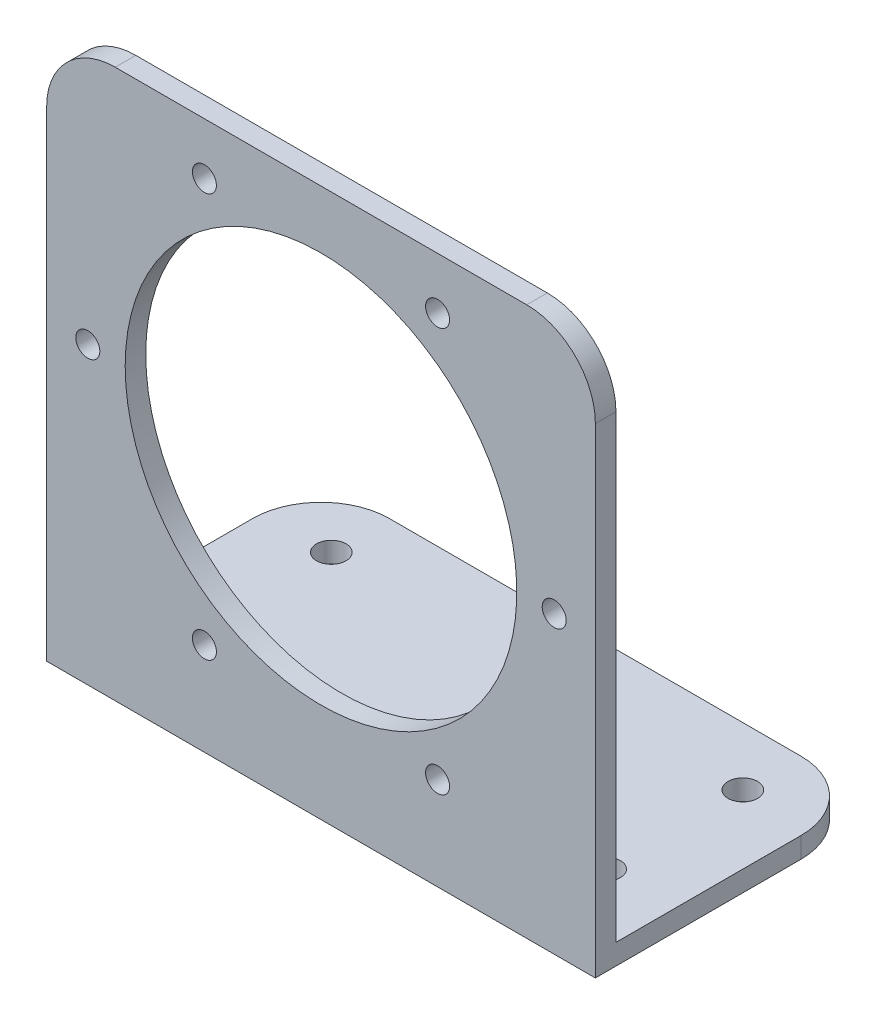
ISO-10303-21;
HEADER;
FILE_DESCRIPTION(('STEP AP214'),'2;1');
FILE_NAME('part.step','',(''),(''),'','','');
FILE_SCHEMA(('AUTOMOTIVE_DESIGN { 1 0 10303 214 1 1 1 1 }'));
ENDSEC;
DATA;
#1=APPLICATION_CONTEXT('core data for automotive mechanical design processes');
#2=APPLICATION_PROTOCOL_DEFINITION('international standard','automotive_design',2000,#1);
#3=PRODUCT_CONTEXT('',#1,'mechanical');
#4=PRODUCT('Part','Part','',(#3));
#5=PRODUCT_RELATED_PRODUCT_CATEGORY('part','',(#4));
#6=PRODUCT_DEFINITION_FORMATION('','',#4);
#7=PRODUCT_DEFINITION_CONTEXT('part definition',#1,'design');
#8=PRODUCT_DEFINITION('design','',#6,#7);
#9=PRODUCT_DEFINITION_SHAPE('','',#8);
#10=(LENGTH_UNIT() NAMED_UNIT(*) SI_UNIT(.MILLI.,.METRE.));
#11=(NAMED_UNIT(*) PLANE_ANGLE_UNIT() SI_UNIT($,.RADIAN.));
#12=(NAMED_UNIT(*) SI_UNIT($,.STERADIAN.) SOLID_ANGLE_UNIT());
#13=UNCERTAINTY_MEASURE_WITH_UNIT(LENGTH_MEASURE(1.E-05),#10,'distance_accuracy_value','');
#14=(GEOMETRIC_REPRESENTATION_CONTEXT(3) GLOBAL_UNCERTAINTY_ASSIGNED_CONTEXT((#13)) GLOBAL_UNIT_ASSIGNED_CONTEXT((#10,
#11,#12)) REPRESENTATION_CONTEXT('',''));
#15=CARTESIAN_POINT('',(0.,0.,0.));
#16=DIRECTION('',(0.,0.,1.));
#17=DIRECTION('',(1.,0.,0.));
#18=AXIS2_PLACEMENT_3D('',#15,#16,#17);
#19=CARTESIAN_POINT('',(40.,0.,0.));
#20=DIRECTION('',(0.,1.,0.));
#21=DIRECTION('',(0.,0.,1.));
#22=AXIS2_PLACEMENT_3D('',#19,#20,#21);
#23=PLANE('',#22);
#24=CARTESIAN_POINT('',(30.,0.,-31.5));
#25=DIRECTION('',(0.,1.,0.));
#26=DIRECTION('',(0.,0.,-1.));
#27=AXIS2_PLACEMENT_3D('',#24,#25,#26);
#28=CIRCLE('',#27,2.15);
#29=CARTESIAN_POINT('',(30.,0.,-33.65));
#30=VERTEX_POINT('',#29);
#31=EDGE_CURVE('E339',#30,#30,#28,.T.);
#32=ORIENTED_EDGE('',*,*,#31,.T.);
#33=EDGE_LOOP('',(#32));
#34=FACE_BOUND('',#33,.T.);
#35=CARTESIAN_POINT('',(30.,0.,-11.5));
#36=DIRECTION('',(0.,1.,0.));
#37=DIRECTION('',(0.,0.,1.));
#38=AXIS2_PLACEMENT_3D('',#35,#36,#37);
#39=CIRCLE('',#38,2.15);
#40=CARTESIAN_POINT('',(30.,0.,-9.35));
#41=VERTEX_POINT('',#40);
#42=EDGE_CURVE('E329',#41,#41,#39,.T.);
#43=ORIENTED_EDGE('',*,*,#42,.T.);
#44=EDGE_LOOP('',(#43));
#45=FACE_BOUND('',#44,.T.);
#46=CARTESIAN_POINT('',(-30.,0.,-11.5));
#47=DIRECTION('',(0.,1.,0.));
#48=DIRECTION('',(0.,0.,-1.));
#49=AXIS2_PLACEMENT_3D('',#46,#47,#48);
#50=CIRCLE('',#49,2.15);
#51=CARTESIAN_POINT('',(-30.,0.,-13.65));
#52=VERTEX_POINT('',#51);
#53=EDGE_CURVE('E324',#52,#52,#50,.T.);
#54=ORIENTED_EDGE('',*,*,#53,.T.);
#55=EDGE_LOOP('',(#54));
#56=FACE_BOUND('',#55,.T.);
#57=CARTESIAN_POINT('',(-30.,0.,-31.5));
#58=DIRECTION('',(0.,1.,0.));
#59=DIRECTION('',(0.,0.,1.));
#60=AXIS2_PLACEMENT_3D('',#57,#58,#59);
#61=CIRCLE('',#60,2.15);
#62=CARTESIAN_POINT('',(-30.,0.,-29.35));
#63=VERTEX_POINT('',#62);
#64=EDGE_CURVE('E345',#63,#63,#61,.T.);
#65=ORIENTED_EDGE('',*,*,#64,.T.);
#66=EDGE_LOOP('',(#65));
#67=FACE_BOUND('',#66,.T.);
#68=DIRECTION('',(0.,0.,-1.));
#69=VECTOR('',#68,1.);
#70=CARTESIAN_POINT('',(-40.,0.,0.));
#71=LINE('',#70,#69);
#72=CARTESIAN_POINT('',(-40.,0.,0.));
#73=VERTEX_POINT('',#72);
#74=CARTESIAN_POINT('',(-40.,0.,-30.));
#75=VERTEX_POINT('',#74);
#76=EDGE_CURVE('E169',#73,#75,#71,.T.);
#77=ORIENTED_EDGE('',*,*,#76,.T.);
#78=CARTESIAN_POINT('',(-30.,0.,-30.));
#79=DIRECTION('',(0.,1.,0.));
#80=DIRECTION('',(0.,0.,1.));
#81=AXIS2_PLACEMENT_3D('',#78,#79,#80);
#82=CIRCLE('',#81,10.);
#83=CARTESIAN_POINT('',(-30.,0.,-40.));
#84=VERTEX_POINT('',#83);
#85=EDGE_CURVE('E12',#75,#84,#82,.F.);
#86=ORIENTED_EDGE('',*,*,#85,.T.);
#87=DIRECTION('',(-1.,0.,0.));
#88=VECTOR('',#87,1.);
#89=CARTESIAN_POINT('',(40.,0.,-40.));
#90=LINE('',#89,#88);
#91=CARTESIAN_POINT('',(30.,0.,-40.));
#92=VERTEX_POINT('',#91);
#93=EDGE_CURVE('E174',#92,#84,#90,.T.);
#94=ORIENTED_EDGE('',*,*,#93,.F.);
#95=CARTESIAN_POINT('',(30.,0.,-30.));
#96=DIRECTION('',(0.,1.,0.));
#97=DIRECTION('',(0.,0.,1.));
#98=AXIS2_PLACEMENT_3D('',#95,#96,#97);
#99=CIRCLE('',#98,10.);
#100=CARTESIAN_POINT('',(40.,0.,-30.));
#101=VERTEX_POINT('',#100);
#102=EDGE_CURVE('E67',#92,#101,#99,.F.);
#103=ORIENTED_EDGE('',*,*,#102,.T.);
#104=DIRECTION('',(0.,0.,-1.));
#105=VECTOR('',#104,1.);
#106=CARTESIAN_POINT('',(40.,0.,0.));
#107=LINE('',#106,#105);
#108=CARTESIAN_POINT('',(40.,0.,0.));
#109=VERTEX_POINT('',#108);
#110=EDGE_CURVE('E164',#109,#101,#107,.T.);
#111=ORIENTED_EDGE('',*,*,#110,.F.);
#112=DIRECTION('',(-1.,0.,0.));
#113=VECTOR('',#112,1.);
#114=CARTESIAN_POINT('',(40.,0.,0.));
#115=LINE('',#114,#113);
#116=EDGE_CURVE('E179',#109,#73,#115,.T.);
#117=ORIENTED_EDGE('',*,*,#116,.T.);
#118=EDGE_LOOP('',(#77,#86,#94,#103,#111,#117));
#119=FACE_BOUND('',#118,.T.);
#120=ADVANCED_FACE('F59',(#34,#45,#56,#67,#119),#23,.F.);
#121=CARTESIAN_POINT('',(40.,0.,-40.));
#122=DIRECTION('',(0.,0.,1.));
#123=DIRECTION('',(1.,0.,0.));
#124=AXIS2_PLACEMENT_3D('',#121,#122,#123);
#125=PLANE('',#124);
#126=ORIENTED_EDGE('',*,*,#93,.T.);
#127=DIRECTION('',(0.,1.,0.));
#128=VECTOR('',#127,1.);
#129=CARTESIAN_POINT('',(-30.,0.,-40.));
#130=LINE('',#129,#128);
#131=CARTESIAN_POINT('',(-30.,3.,-40.));
#132=VERTEX_POINT('',#131);
#133=EDGE_CURVE('E212',#84,#132,#130,.T.);
#134=ORIENTED_EDGE('',*,*,#133,.T.);
#135=DIRECTION('',(-1.,0.,0.));
#136=VECTOR('',#135,1.);
#137=CARTESIAN_POINT('',(40.,3.,-40.));
#138=LINE('',#137,#136);
#139=CARTESIAN_POINT('',(30.,3.,-40.));
#140=VERTEX_POINT('',#139);
#141=EDGE_CURVE('E147',#140,#132,#138,.T.);
#142=ORIENTED_EDGE('',*,*,#141,.F.);
#143=DIRECTION('',(0.,1.,0.));
#144=VECTOR('',#143,1.);
#145=CARTESIAN_POINT('',(30.,0.,-40.));
#146=LINE('',#145,#144);
#147=EDGE_CURVE('E79',#140,#92,#146,.F.);
#148=ORIENTED_EDGE('',*,*,#147,.T.);
#149=EDGE_LOOP('',(#126,#134,#142,#148));
#150=FACE_BOUND('',#149,.T.);
#151=ADVANCED_FACE('F222',(#150),#125,.F.);
#152=CARTESIAN_POINT('',(40.,3.,0.));
#153=DIRECTION('',(0.,1.,0.));
#154=DIRECTION('',(0.,0.,1.));
#155=AXIS2_PLACEMENT_3D('',#152,#153,#154);
#156=PLANE('',#155);
#157=CARTESIAN_POINT('',(30.,3.,-31.5));
#158=DIRECTION('',(0.,1.,0.));
#159=DIRECTION('',(0.,0.,-1.));
#160=AXIS2_PLACEMENT_3D('',#157,#158,#159);
#161=CIRCLE('',#160,2.15);
#162=CARTESIAN_POINT('',(30.,3.,-33.65));
#163=VERTEX_POINT('',#162);
#164=EDGE_CURVE('E342',#163,#163,#161,.T.);
#165=ORIENTED_EDGE('',*,*,#164,.F.);
#166=EDGE_LOOP('',(#165));
#167=FACE_BOUND('',#166,.T.);
#168=CARTESIAN_POINT('',(30.,3.,-11.5));
#169=DIRECTION('',(0.,1.,0.));
#170=DIRECTION('',(0.,0.,1.));
#171=AXIS2_PLACEMENT_3D('',#168,#169,#170);
#172=CIRCLE('',#171,2.15);
#173=CARTESIAN_POINT('',(30.,3.,-9.35));
#174=VERTEX_POINT('',#173);
#175=EDGE_CURVE('E334',#174,#174,#172,.T.);
#176=ORIENTED_EDGE('',*,*,#175,.F.);
#177=EDGE_LOOP('',(#176));
#178=FACE_BOUND('',#177,.T.);
#179=CARTESIAN_POINT('',(-30.,3.,-11.5));
#180=DIRECTION('',(0.,1.,0.));
#181=DIRECTION('',(0.,0.,-1.));
#182=AXIS2_PLACEMENT_3D('',#179,#180,#181);
#183=CIRCLE('',#182,2.15);
#184=CARTESIAN_POINT('',(-30.,3.,-13.65));
#185=VERTEX_POINT('',#184);
#186=EDGE_CURVE('E327',#185,#185,#183,.T.);
#187=ORIENTED_EDGE('',*,*,#186,.F.);
#188=EDGE_LOOP('',(#187));
#189=FACE_BOUND('',#188,.T.);
#190=CARTESIAN_POINT('',(-30.,3.,-31.5));
#191=DIRECTION('',(0.,1.,0.));
#192=DIRECTION('',(0.,0.,1.));
#193=AXIS2_PLACEMENT_3D('',#190,#191,#192);
#194=CIRCLE('',#193,2.15);
#195=CARTESIAN_POINT('',(-30.,3.,-29.35));
#196=VERTEX_POINT('',#195);
#197=EDGE_CURVE('E331',#196,#196,#194,.T.);
#198=ORIENTED_EDGE('',*,*,#197,.F.);
#199=EDGE_LOOP('',(#198));
#200=FACE_BOUND('',#199,.T.);
#201=ORIENTED_EDGE('',*,*,#141,.T.);
#202=CARTESIAN_POINT('',(-30.,3.,-30.));
#203=DIRECTION('',(0.,1.,0.));
#204=DIRECTION('',(0.,0.,1.));
#205=AXIS2_PLACEMENT_3D('',#202,#203,#204);
#206=CIRCLE('',#205,10.);
#207=CARTESIAN_POINT('',(-40.,3.,-30.));
#208=VERTEX_POINT('',#207);
#209=EDGE_CURVE('E217',#132,#208,#206,.T.);
#210=ORIENTED_EDGE('',*,*,#209,.T.);
#211=DIRECTION('',(0.,0.,-1.));
#212=VECTOR('',#211,1.);
#213=CARTESIAN_POINT('',(-40.,3.,0.));
#214=LINE('',#213,#212);
#215=CARTESIAN_POINT('',(-40.,3.,-3.));
#216=VERTEX_POINT('',#215);
#217=EDGE_CURVE('E143',#216,#208,#214,.T.);
#218=ORIENTED_EDGE('',*,*,#217,.F.);
#219=DIRECTION('',(-1.,0.,0.));
#220=VECTOR('',#219,1.);
#221=CARTESIAN_POINT('',(40.,3.,-3.));
#222=LINE('',#221,#220);
#223=CARTESIAN_POINT('',(40.,3.,-3.));
#224=VERTEX_POINT('',#223);
#225=EDGE_CURVE('E136',#224,#216,#222,.T.);
#226=ORIENTED_EDGE('',*,*,#225,.F.);
#227=DIRECTION('',(0.,0.,-1.));
#228=VECTOR('',#227,1.);
#229=CARTESIAN_POINT('',(40.,3.,0.));
#230=LINE('',#229,#228);
#231=CARTESIAN_POINT('',(40.,3.,-30.));
#232=VERTEX_POINT('',#231);
#233=EDGE_CURVE('E141',#224,#232,#230,.T.);
#234=ORIENTED_EDGE('',*,*,#233,.T.);
#235=CARTESIAN_POINT('',(30.,3.,-30.));
#236=DIRECTION('',(0.,1.,0.));
#237=DIRECTION('',(0.,0.,1.));
#238=AXIS2_PLACEMENT_3D('',#235,#236,#237);
#239=CIRCLE('',#238,10.);
#240=EDGE_CURVE('E215',#232,#140,#239,.T.);
#241=ORIENTED_EDGE('',*,*,#240,.T.);
#242=EDGE_LOOP('',(#201,#210,#218,#226,#234,#241));
#243=FACE_BOUND('',#242,.T.);
#244=ADVANCED_FACE('F139',(#167,#178,#189,#200,#243),#156,.T.);
#245=CARTESIAN_POINT('',(40.,0.,0.));
#246=DIRECTION('',(1.,0.,0.));
#247=DIRECTION('',(0.,0.,-1.));
#248=AXIS2_PLACEMENT_3D('',#245,#246,#247);
#249=PLANE('',#248);
#250=DIRECTION('',(0.,1.,0.));
#251=VECTOR('',#250,1.);
#252=CARTESIAN_POINT('',(40.,0.,-3.));
#253=LINE('',#252,#251);
#254=CARTESIAN_POINT('',(40.,70.,-3.));
#255=VERTEX_POINT('',#254);
#256=EDGE_CURVE('E150',#224,#255,#253,.T.);
#257=ORIENTED_EDGE('',*,*,#256,.T.);
#258=DIRECTION('',(0.,0.,-1.));
#259=VECTOR('',#258,1.);
#260=CARTESIAN_POINT('',(40.,70.,0.));
#261=LINE('',#260,#259);
#262=CARTESIAN_POINT('',(40.,70.,0.));
#263=VERTEX_POINT('',#262);
#264=EDGE_CURVE('E209',#255,#263,#261,.F.);
#265=ORIENTED_EDGE('',*,*,#264,.T.);
#266=DIRECTION('',(0.,1.,0.));
#267=VECTOR('',#266,1.);
#268=CARTESIAN_POINT('',(40.,0.,0.));
#269=LINE('',#268,#267);
#270=EDGE_CURVE('E156',#109,#263,#269,.T.);
#271=ORIENTED_EDGE('',*,*,#270,.F.);
#272=ORIENTED_EDGE('',*,*,#110,.T.);
#273=DIRECTION('',(0.,1.,0.));
#274=VECTOR('',#273,1.);
#275=CARTESIAN_POINT('',(40.,3.,-30.));
#276=LINE('',#275,#274);
#277=EDGE_CURVE('E163',#101,#232,#276,.T.);
#278=ORIENTED_EDGE('',*,*,#277,.T.);
#279=ORIENTED_EDGE('',*,*,#233,.F.);
#280=EDGE_LOOP('',(#257,#265,#271,#272,#278,#279));
#281=FACE_BOUND('',#280,.T.);
#282=ADVANCED_FACE('F160',(#281),#249,.T.);
#283=CARTESIAN_POINT('',(-40.,0.,0.));
#284=DIRECTION('',(1.,0.,0.));
#285=DIRECTION('',(0.,0.,-1.));
#286=AXIS2_PLACEMENT_3D('',#283,#284,#285);
#287=PLANE('',#286);
#288=DIRECTION('',(0.,1.,0.));
#289=VECTOR('',#288,1.);
#290=CARTESIAN_POINT('',(-40.,0.,0.));
#291=LINE('',#290,#289);
#292=CARTESIAN_POINT('',(-40.,70.,0.));
#293=VERTEX_POINT('',#292);
#294=EDGE_CURVE('E157',#73,#293,#291,.T.);
#295=ORIENTED_EDGE('',*,*,#294,.T.);
#296=DIRECTION('',(0.,0.,-1.));
#297=VECTOR('',#296,1.);
#298=CARTESIAN_POINT('',(-40.,70.,-3.));
#299=LINE('',#298,#297);
#300=CARTESIAN_POINT('',(-40.,70.,-3.));
#301=VERTEX_POINT('',#300);
#302=EDGE_CURVE('E193',#293,#301,#299,.T.);
#303=ORIENTED_EDGE('',*,*,#302,.T.);
#304=DIRECTION('',(0.,1.,0.));
#305=VECTOR('',#304,1.);
#306=CARTESIAN_POINT('',(-40.,0.,-3.));
#307=LINE('',#306,#305);
#308=EDGE_CURVE('E180',#216,#301,#307,.T.);
#309=ORIENTED_EDGE('',*,*,#308,.F.);
#310=ORIENTED_EDGE('',*,*,#217,.T.);
#311=DIRECTION('',(0.,1.,0.));
#312=VECTOR('',#311,1.);
#313=CARTESIAN_POINT('',(-40.,0.,-30.));
#314=LINE('',#313,#312);
#315=EDGE_CURVE('E175',#208,#75,#314,.F.);
#316=ORIENTED_EDGE('',*,*,#315,.T.);
#317=ORIENTED_EDGE('',*,*,#76,.F.);
#318=EDGE_LOOP('',(#295,#303,#309,#310,#316,#317));
#319=FACE_BOUND('',#318,.T.);
#320=ADVANCED_FACE('F228',(#319),#287,.F.);
#321=CARTESIAN_POINT('',(40.,0.,0.));
#322=DIRECTION('',(0.,0.,1.));
#323=DIRECTION('',(1.,0.,0.));
#324=AXIS2_PLACEMENT_3D('',#321,#322,#323);
#325=PLANE('',#324);
#326=CARTESIAN_POINT('',(16.9999999999998,13.555136271329,0.));
#327=DIRECTION('',(0.,0.,-1.));
#328=DIRECTION('',(-1.,0.,0.));
#329=AXIS2_PLACEMENT_3D('',#326,#327,#328);
#330=CIRCLE('',#329,1.75);
#331=CARTESIAN_POINT('',(15.2499999999998,13.555136271329,0.));
#332=VERTEX_POINT('',#331);
#333=EDGE_CURVE('E370',#332,#332,#330,.T.);
#334=ORIENTED_EDGE('',*,*,#333,.T.);
#335=EDGE_LOOP('',(#334));
#336=FACE_BOUND('',#335,.T.);
#337=CARTESIAN_POINT('',(-17.0000000000002,13.5551362713292,0.));
#338=DIRECTION('',(0.,0.,-1.));
#339=DIRECTION('',(-1.,0.,0.));
#340=AXIS2_PLACEMENT_3D('',#337,#338,#339);
#341=CIRCLE('',#340,1.75);
#342=CARTESIAN_POINT('',(-18.7500000000002,13.5551362713292,0.));
#343=VERTEX_POINT('',#342);
#344=EDGE_CURVE('E363',#343,#343,#341,.T.);
#345=ORIENTED_EDGE('',*,*,#344,.T.);
#346=EDGE_LOOP('',(#345));
#347=FACE_BOUND('',#346,.T.);
#348=CARTESIAN_POINT('',(-34.,43.0000000000002,0.));
#349=DIRECTION('',(0.,0.,-1.));
#350=DIRECTION('',(-1.,0.,0.));
#351=AXIS2_PLACEMENT_3D('',#348,#349,#350);
#352=CIRCLE('',#351,1.75);
#353=CARTESIAN_POINT('',(-35.75,43.0000000000002,0.));
#354=VERTEX_POINT('',#353);
#355=EDGE_CURVE('E382',#354,#354,#352,.T.);
#356=ORIENTED_EDGE('',*,*,#355,.T.);
#357=EDGE_LOOP('',(#356));
#358=FACE_BOUND('',#357,.T.);
#359=CARTESIAN_POINT('',(0.,43.,0.));
#360=DIRECTION('',(0.,0.,-1.));
#361=DIRECTION('',(-1.,0.,0.));
#362=AXIS2_PLACEMENT_3D('',#359,#360,#361);
#363=CIRCLE('',#362,28.55);
#364=CARTESIAN_POINT('',(-28.55,43.,0.));
#365=VERTEX_POINT('',#364);
#366=EDGE_CURVE('E375',#365,#365,#363,.T.);
#367=ORIENTED_EDGE('',*,*,#366,.T.);
#368=EDGE_LOOP('',(#367));
#369=FACE_BOUND('',#368,.T.);
#370=CARTESIAN_POINT('',(34.,42.9999999999998,0.));
#371=DIRECTION('',(0.,0.,-1.));
#372=DIRECTION('',(-1.,0.,0.));
#373=AXIS2_PLACEMENT_3D('',#370,#371,#372);
#374=CIRCLE('',#373,1.75);
#375=CARTESIAN_POINT('',(32.25,42.9999999999998,0.));
#376=VERTEX_POINT('',#375);
#377=EDGE_CURVE('E351',#376,#376,#374,.T.);
#378=ORIENTED_EDGE('',*,*,#377,.T.);
#379=EDGE_LOOP('',(#378));
#380=FACE_BOUND('',#379,.T.);
#381=CARTESIAN_POINT('',(17.0000000000002,72.4448637286708,0.));
#382=DIRECTION('',(0.,0.,-1.));
#383=DIRECTION('',(-1.,0.,0.));
#384=AXIS2_PLACEMENT_3D('',#381,#382,#383);
#385=CIRCLE('',#384,1.75);
#386=CARTESIAN_POINT('',(15.2500000000002,72.4448637286708,0.));
#387=VERTEX_POINT('',#386);
#388=EDGE_CURVE('E358',#387,#387,#385,.T.);
#389=ORIENTED_EDGE('',*,*,#388,.T.);
#390=EDGE_LOOP('',(#389));
#391=FACE_BOUND('',#390,.T.);
#392=CARTESIAN_POINT('',(-16.9999999999998,72.444863728671,0.));
#393=DIRECTION('',(0.,0.,-1.));
#394=DIRECTION('',(-1.,0.,0.));
#395=AXIS2_PLACEMENT_3D('',#392,#393,#394);
#396=CIRCLE('',#395,1.75);
#397=CARTESIAN_POINT('',(-18.7499999999998,72.444863728671,0.));
#398=VERTEX_POINT('',#397);
#399=EDGE_CURVE('E182',#398,#398,#396,.T.);
#400=ORIENTED_EDGE('',*,*,#399,.T.);
#401=EDGE_LOOP('',(#400));
#402=FACE_BOUND('',#401,.T.);
#403=DIRECTION('',(-1.,0.,0.));
#404=VECTOR('',#403,1.);
#405=CARTESIAN_POINT('',(40.,80.,0.));
#406=LINE('',#405,#404);
#407=CARTESIAN_POINT('',(30.,80.,0.));
#408=VERTEX_POINT('',#407);
#409=CARTESIAN_POINT('',(-30.,80.,0.));
#410=VERTEX_POINT('',#409);
#411=EDGE_CURVE('E187',#408,#410,#406,.T.);
#412=ORIENTED_EDGE('',*,*,#411,.T.);
#413=CARTESIAN_POINT('',(-30.,70.,0.));
#414=DIRECTION('',(0.,0.,1.));
#415=DIRECTION('',(1.,0.,0.));
#416=AXIS2_PLACEMENT_3D('',#413,#414,#415);
#417=CIRCLE('',#416,10.);
#418=EDGE_CURVE('E206',#410,#293,#417,.T.);
#419=ORIENTED_EDGE('',*,*,#418,.T.);
#420=ORIENTED_EDGE('',*,*,#294,.F.);
#421=ORIENTED_EDGE('',*,*,#116,.F.);
#422=ORIENTED_EDGE('',*,*,#270,.T.);
#423=CARTESIAN_POINT('',(30.,70.,0.));
#424=DIRECTION('',(0.,0.,1.));
#425=DIRECTION('',(1.,0.,0.));
#426=AXIS2_PLACEMENT_3D('',#423,#424,#425);
#427=CIRCLE('',#426,10.);
#428=EDGE_CURVE('E204',#263,#408,#427,.T.);
#429=ORIENTED_EDGE('',*,*,#428,.T.);
#430=EDGE_LOOP('',(#412,#419,#420,#421,#422,#429));
#431=FACE_BOUND('',#430,.T.);
#432=ADVANCED_FACE('F240',(#336,#347,#358,#369,#380,#391,#402,#431),#325,.T.);
#433=CARTESIAN_POINT('',(40.,80.,0.));
#434=DIRECTION('',(0.,1.,0.));
#435=DIRECTION('',(0.,0.,1.));
#436=AXIS2_PLACEMENT_3D('',#433,#434,#435);
#437=PLANE('',#436);
#438=DIRECTION('',(-1.,0.,0.));
#439=VECTOR('',#438,1.);
#440=CARTESIAN_POINT('',(40.,80.,-3.));
#441=LINE('',#440,#439);
#442=CARTESIAN_POINT('',(30.,80.,-3.));
#443=VERTEX_POINT('',#442);
#444=CARTESIAN_POINT('',(-30.,80.,-3.));
#445=VERTEX_POINT('',#444);
#446=EDGE_CURVE('E171',#443,#445,#441,.T.);
#447=ORIENTED_EDGE('',*,*,#446,.T.);
#448=DIRECTION('',(0.,0.,-1.));
#449=VECTOR('',#448,1.);
#450=CARTESIAN_POINT('',(-30.,80.,0.));
#451=LINE('',#450,#449);
#452=EDGE_CURVE('E202',#445,#410,#451,.F.);
#453=ORIENTED_EDGE('',*,*,#452,.T.);
#454=ORIENTED_EDGE('',*,*,#411,.F.);
#455=DIRECTION('',(0.,0.,-1.));
#456=VECTOR('',#455,1.);
#457=CARTESIAN_POINT('',(30.,80.,0.));
#458=LINE('',#457,#456);
#459=EDGE_CURVE('E199',#408,#443,#458,.T.);
#460=ORIENTED_EDGE('',*,*,#459,.T.);
#461=EDGE_LOOP('',(#447,#453,#454,#460));
#462=FACE_BOUND('',#461,.T.);
#463=ADVANCED_FACE('F233',(#462),#437,.T.);
#464=CARTESIAN_POINT('',(40.,0.,-3.));
#465=DIRECTION('',(0.,0.,1.));
#466=DIRECTION('',(1.,0.,0.));
#467=AXIS2_PLACEMENT_3D('',#464,#465,#466);
#468=PLANE('',#467);
#469=CARTESIAN_POINT('',(16.9999999999998,13.555136271329,-3.));
#470=DIRECTION('',(0.,0.,-1.));
#471=DIRECTION('',(-1.,0.,0.));
#472=AXIS2_PLACEMENT_3D('',#469,#470,#471);
#473=CIRCLE('',#472,1.75);
#474=CARTESIAN_POINT('',(15.2499999999998,13.555136271329,-3.));
#475=VERTEX_POINT('',#474);
#476=EDGE_CURVE('E354',#475,#475,#473,.T.);
#477=ORIENTED_EDGE('',*,*,#476,.F.);
#478=EDGE_LOOP('',(#477));
#479=FACE_BOUND('',#478,.T.);
#480=CARTESIAN_POINT('',(-17.0000000000002,13.5551362713292,-3.));
#481=DIRECTION('',(0.,0.,-1.));
#482=DIRECTION('',(-1.,0.,0.));
#483=AXIS2_PLACEMENT_3D('',#480,#481,#482);
#484=CIRCLE('',#483,1.75);
#485=CARTESIAN_POINT('',(-18.7500000000002,13.5551362713292,-3.));
#486=VERTEX_POINT('',#485);
#487=EDGE_CURVE('E367',#486,#486,#484,.T.);
#488=ORIENTED_EDGE('',*,*,#487,.F.);
#489=EDGE_LOOP('',(#488));
#490=FACE_BOUND('',#489,.T.);
#491=CARTESIAN_POINT('',(-34.,43.0000000000002,-3.));
#492=DIRECTION('',(0.,0.,-1.));
#493=DIRECTION('',(-1.,0.,0.));
#494=AXIS2_PLACEMENT_3D('',#491,#492,#493);
#495=CIRCLE('',#494,1.75);
#496=CARTESIAN_POINT('',(-35.75,43.0000000000002,-3.));
#497=VERTEX_POINT('',#496);
#498=EDGE_CURVE('E366',#497,#497,#495,.T.);
#499=ORIENTED_EDGE('',*,*,#498,.F.);
#500=EDGE_LOOP('',(#499));
#501=FACE_BOUND('',#500,.T.);
#502=CARTESIAN_POINT('',(0.,43.,-3.));
#503=DIRECTION('',(0.,0.,-1.));
#504=DIRECTION('',(-1.,0.,0.));
#505=AXIS2_PLACEMENT_3D('',#502,#503,#504);
#506=CIRCLE('',#505,28.55);
#507=CARTESIAN_POINT('',(-28.55,43.,-3.));
#508=VERTEX_POINT('',#507);
#509=EDGE_CURVE('E379',#508,#508,#506,.T.);
#510=ORIENTED_EDGE('',*,*,#509,.F.);
#511=EDGE_LOOP('',(#510));
#512=FACE_BOUND('',#511,.T.);
#513=CARTESIAN_POINT('',(34.,42.9999999999998,-3.));
#514=DIRECTION('',(0.,0.,-1.));
#515=DIRECTION('',(-1.,0.,0.));
#516=AXIS2_PLACEMENT_3D('',#513,#514,#515);
#517=CIRCLE('',#516,1.75);
#518=CARTESIAN_POINT('',(32.25,42.9999999999998,-3.));
#519=VERTEX_POINT('',#518);
#520=EDGE_CURVE('E355',#519,#519,#517,.T.);
#521=ORIENTED_EDGE('',*,*,#520,.F.);
#522=EDGE_LOOP('',(#521));
#523=FACE_BOUND('',#522,.T.);
#524=CARTESIAN_POINT('',(17.0000000000002,72.4448637286708,-3.));
#525=DIRECTION('',(0.,0.,-1.));
#526=DIRECTION('',(-1.,0.,0.));
#527=AXIS2_PLACEMENT_3D('',#524,#525,#526);
#528=CIRCLE('',#527,1.75);
#529=CARTESIAN_POINT('',(15.2500000000002,72.4448637286708,-3.));
#530=VERTEX_POINT('',#529);
#531=EDGE_CURVE('E348',#530,#530,#528,.T.);
#532=ORIENTED_EDGE('',*,*,#531,.F.);
#533=EDGE_LOOP('',(#532));
#534=FACE_BOUND('',#533,.T.);
#535=CARTESIAN_POINT('',(-16.9999999999998,72.444863728671,-3.));
#536=DIRECTION('',(0.,0.,-1.));
#537=DIRECTION('',(-1.,0.,0.));
#538=AXIS2_PLACEMENT_3D('',#535,#536,#537);
#539=CIRCLE('',#538,1.75);
#540=CARTESIAN_POINT('',(-18.7499999999998,72.444863728671,-3.));
#541=VERTEX_POINT('',#540);
#542=EDGE_CURVE('E378',#541,#541,#539,.T.);
#543=ORIENTED_EDGE('',*,*,#542,.F.);
#544=EDGE_LOOP('',(#543));
#545=FACE_BOUND('',#544,.T.);
#546=ORIENTED_EDGE('',*,*,#308,.T.);
#547=CARTESIAN_POINT('',(-30.,70.,-3.));
#548=DIRECTION('',(0.,0.,1.));
#549=DIRECTION('',(1.,0.,0.));
#550=AXIS2_PLACEMENT_3D('',#547,#548,#549);
#551=CIRCLE('',#550,10.);
#552=EDGE_CURVE('E197',#301,#445,#551,.F.);
#553=ORIENTED_EDGE('',*,*,#552,.T.);
#554=ORIENTED_EDGE('',*,*,#446,.F.);
#555=CARTESIAN_POINT('',(30.,70.,-3.));
#556=DIRECTION('',(0.,0.,1.));
#557=DIRECTION('',(1.,0.,0.));
#558=AXIS2_PLACEMENT_3D('',#555,#556,#557);
#559=CIRCLE('',#558,10.);
#560=EDGE_CURVE('E153',#443,#255,#559,.F.);
#561=ORIENTED_EDGE('',*,*,#560,.T.);
#562=ORIENTED_EDGE('',*,*,#256,.F.);
#563=ORIENTED_EDGE('',*,*,#225,.T.);
#564=EDGE_LOOP('',(#546,#553,#554,#561,#562,#563));
#565=FACE_BOUND('',#564,.T.);
#566=ADVANCED_FACE('F151',(#479,#490,#501,#512,#523,#534,#545,#565),#468,.F.);
#567=CARTESIAN_POINT('',(-16.9999999999998,72.444863728671,0.));
#568=DIRECTION('',(0.,0.,-1.));
#569=DIRECTION('',(-1.,0.,0.));
#570=AXIS2_PLACEMENT_3D('',#567,#568,#569);
#571=CYLINDRICAL_SURFACE('',#570,1.75);
#572=ORIENTED_EDGE('',*,*,#399,.F.);
#573=EDGE_LOOP('',(#572));
#574=FACE_BOUND('',#573,.T.);
#575=ORIENTED_EDGE('',*,*,#542,.T.);
#576=EDGE_LOOP('',(#575));
#577=FACE_BOUND('',#576,.T.);
#578=ADVANCED_FACE('F253',(#574,#577),#571,.F.);
#579=CARTESIAN_POINT('',(17.0000000000002,72.4448637286708,0.));
#580=DIRECTION('',(0.,0.,-1.));
#581=DIRECTION('',(-1.,0.,0.));
#582=AXIS2_PLACEMENT_3D('',#579,#580,#581);
#583=CYLINDRICAL_SURFACE('',#582,1.75);
#584=ORIENTED_EDGE('',*,*,#388,.F.);
#585=EDGE_LOOP('',(#584));
#586=FACE_BOUND('',#585,.T.);
#587=ORIENTED_EDGE('',*,*,#531,.T.);
#588=EDGE_LOOP('',(#587));
#589=FACE_BOUND('',#588,.T.);
#590=ADVANCED_FACE('F260',(#586,#589),#583,.F.);
#591=CARTESIAN_POINT('',(34.,42.9999999999998,0.));
#592=DIRECTION('',(0.,0.,-1.));
#593=DIRECTION('',(-1.,0.,0.));
#594=AXIS2_PLACEMENT_3D('',#591,#592,#593);
#595=CYLINDRICAL_SURFACE('',#594,1.75);
#596=ORIENTED_EDGE('',*,*,#377,.F.);
#597=EDGE_LOOP('',(#596));
#598=FACE_BOUND('',#597,.T.);
#599=ORIENTED_EDGE('',*,*,#520,.T.);
#600=EDGE_LOOP('',(#599));
#601=FACE_BOUND('',#600,.T.);
#602=ADVANCED_FACE('F290',(#598,#601),#595,.F.);
#603=CARTESIAN_POINT('',(0.,43.,0.));
#604=DIRECTION('',(0.,0.,-1.));
#605=DIRECTION('',(-1.,0.,0.));
#606=AXIS2_PLACEMENT_3D('',#603,#604,#605);
#607=CYLINDRICAL_SURFACE('',#606,28.55);
#608=ORIENTED_EDGE('',*,*,#366,.F.);
#609=EDGE_LOOP('',(#608));
#610=FACE_BOUND('',#609,.T.);
#611=ORIENTED_EDGE('',*,*,#509,.T.);
#612=EDGE_LOOP('',(#611));
#613=FACE_BOUND('',#612,.T.);
#614=ADVANCED_FACE('F286',(#610,#613),#607,.F.);
#615=CARTESIAN_POINT('',(-34.,43.0000000000002,0.));
#616=DIRECTION('',(0.,0.,-1.));
#617=DIRECTION('',(-1.,0.,0.));
#618=AXIS2_PLACEMENT_3D('',#615,#616,#617);
#619=CYLINDRICAL_SURFACE('',#618,1.75);
#620=ORIENTED_EDGE('',*,*,#355,.F.);
#621=EDGE_LOOP('',(#620));
#622=FACE_BOUND('',#621,.T.);
#623=ORIENTED_EDGE('',*,*,#498,.T.);
#624=EDGE_LOOP('',(#623));
#625=FACE_BOUND('',#624,.T.);
#626=ADVANCED_FACE('F282',(#622,#625),#619,.F.);
#627=CARTESIAN_POINT('',(-17.0000000000002,13.5551362713292,0.));
#628=DIRECTION('',(0.,0.,-1.));
#629=DIRECTION('',(-1.,0.,0.));
#630=AXIS2_PLACEMENT_3D('',#627,#628,#629);
#631=CYLINDRICAL_SURFACE('',#630,1.75);
#632=ORIENTED_EDGE('',*,*,#344,.F.);
#633=EDGE_LOOP('',(#632));
#634=FACE_BOUND('',#633,.T.);
#635=ORIENTED_EDGE('',*,*,#487,.T.);
#636=EDGE_LOOP('',(#635));
#637=FACE_BOUND('',#636,.T.);
#638=ADVANCED_FACE('F285',(#634,#637),#631,.F.);
#639=CARTESIAN_POINT('',(16.9999999999998,13.555136271329,0.));
#640=DIRECTION('',(0.,0.,-1.));
#641=DIRECTION('',(-1.,0.,0.));
#642=AXIS2_PLACEMENT_3D('',#639,#640,#641);
#643=CYLINDRICAL_SURFACE('',#642,1.75);
#644=ORIENTED_EDGE('',*,*,#333,.F.);
#645=EDGE_LOOP('',(#644));
#646=FACE_BOUND('',#645,.T.);
#647=ORIENTED_EDGE('',*,*,#476,.T.);
#648=EDGE_LOOP('',(#647));
#649=FACE_BOUND('',#648,.T.);
#650=ADVANCED_FACE('F292',(#646,#649),#643,.F.);
#651=CARTESIAN_POINT('',(-30.,0.,-31.5));
#652=DIRECTION('',(0.,1.,0.));
#653=DIRECTION('',(0.,0.,1.));
#654=AXIS2_PLACEMENT_3D('',#651,#652,#653);
#655=CYLINDRICAL_SURFACE('',#654,2.15);
#656=ORIENTED_EDGE('',*,*,#64,.F.);
#657=EDGE_LOOP('',(#656));
#658=FACE_BOUND('',#657,.T.);
#659=ORIENTED_EDGE('',*,*,#197,.T.);
#660=EDGE_LOOP('',(#659));
#661=FACE_BOUND('',#660,.T.);
#662=ADVANCED_FACE('F295',(#658,#661),#655,.F.);
#663=CARTESIAN_POINT('',(-30.,0.,-11.5));
#664=DIRECTION('',(0.,1.,0.));
#665=DIRECTION('',(0.,0.,1.));
#666=AXIS2_PLACEMENT_3D('',#663,#664,#665);
#667=CYLINDRICAL_SURFACE('',#666,2.15);
#668=ORIENTED_EDGE('',*,*,#53,.F.);
#669=EDGE_LOOP('',(#668));
#670=FACE_BOUND('',#669,.T.);
#671=ORIENTED_EDGE('',*,*,#186,.T.);
#672=EDGE_LOOP('',(#671));
#673=FACE_BOUND('',#672,.T.);
#674=ADVANCED_FACE('F308',(#670,#673),#667,.F.);
#675=CARTESIAN_POINT('',(30.,0.,-11.5));
#676=DIRECTION('',(0.,1.,0.));
#677=DIRECTION('',(0.,0.,1.));
#678=AXIS2_PLACEMENT_3D('',#675,#676,#677);
#679=CYLINDRICAL_SURFACE('',#678,2.15);
#680=ORIENTED_EDGE('',*,*,#42,.F.);
#681=EDGE_LOOP('',(#680));
#682=FACE_BOUND('',#681,.T.);
#683=ORIENTED_EDGE('',*,*,#175,.T.);
#684=EDGE_LOOP('',(#683));
#685=FACE_BOUND('',#684,.T.);
#686=ADVANCED_FACE('F312',(#682,#685),#679,.F.);
#687=CARTESIAN_POINT('',(30.,0.,-31.5));
#688=DIRECTION('',(0.,1.,0.));
#689=DIRECTION('',(0.,0.,1.));
#690=AXIS2_PLACEMENT_3D('',#687,#688,#689);
#691=CYLINDRICAL_SURFACE('',#690,2.15);
#692=ORIENTED_EDGE('',*,*,#31,.F.);
#693=EDGE_LOOP('',(#692));
#694=FACE_BOUND('',#693,.T.);
#695=ORIENTED_EDGE('',*,*,#164,.T.);
#696=EDGE_LOOP('',(#695));
#697=FACE_BOUND('',#696,.T.);
#698=ADVANCED_FACE('F250',(#694,#697),#691,.F.);
#699=CARTESIAN_POINT('',(-30.,70.,0.));
#700=DIRECTION('',(0.,0.,1.));
#701=DIRECTION('',(1.,0.,0.));
#702=AXIS2_PLACEMENT_3D('',#699,#700,#701);
#703=CYLINDRICAL_SURFACE('',#702,10.);
#704=ORIENTED_EDGE('',*,*,#418,.F.);
#705=ORIENTED_EDGE('',*,*,#452,.F.);
#706=ORIENTED_EDGE('',*,*,#552,.F.);
#707=ORIENTED_EDGE('',*,*,#302,.F.);
#708=EDGE_LOOP('',(#704,#705,#706,#707));
#709=FACE_BOUND('',#708,.T.);
#710=ADVANCED_FACE('F237',(#709),#703,.T.);
#711=CARTESIAN_POINT('',(30.,70.,0.));
#712=DIRECTION('',(0.,0.,-1.));
#713=DIRECTION('',(-1.,0.,0.));
#714=AXIS2_PLACEMENT_3D('',#711,#712,#713);
#715=CYLINDRICAL_SURFACE('',#714,10.);
#716=ORIENTED_EDGE('',*,*,#428,.F.);
#717=ORIENTED_EDGE('',*,*,#264,.F.);
#718=ORIENTED_EDGE('',*,*,#560,.F.);
#719=ORIENTED_EDGE('',*,*,#459,.F.);
#720=EDGE_LOOP('',(#716,#717,#718,#719));
#721=FACE_BOUND('',#720,.T.);
#722=ADVANCED_FACE('F243',(#721),#715,.T.);
#723=CARTESIAN_POINT('',(-30.,0.,-30.));
#724=DIRECTION('',(0.,1.,0.));
#725=DIRECTION('',(0.,0.,1.));
#726=AXIS2_PLACEMENT_3D('',#723,#724,#725);
#727=CYLINDRICAL_SURFACE('',#726,10.);
#728=ORIENTED_EDGE('',*,*,#85,.F.);
#729=ORIENTED_EDGE('',*,*,#315,.F.);
#730=ORIENTED_EDGE('',*,*,#209,.F.);
#731=ORIENTED_EDGE('',*,*,#133,.F.);
#732=EDGE_LOOP('',(#728,#729,#730,#731));
#733=FACE_BOUND('',#732,.T.);
#734=ADVANCED_FACE('F225',(#733),#727,.T.);
#735=CARTESIAN_POINT('',(30.,0.,-30.));
#736=DIRECTION('',(0.,-1.,0.));
#737=DIRECTION('',(0.,0.,-1.));
#738=AXIS2_PLACEMENT_3D('',#735,#736,#737);
#739=CYLINDRICAL_SURFACE('',#738,10.);
#740=ORIENTED_EDGE('',*,*,#102,.F.);
#741=ORIENTED_EDGE('',*,*,#147,.F.);
#742=ORIENTED_EDGE('',*,*,#240,.F.);
#743=ORIENTED_EDGE('',*,*,#277,.F.);
#744=EDGE_LOOP('',(#740,#741,#742,#743));
#745=FACE_BOUND('',#744,.T.);
#746=ADVANCED_FACE('F61',(#745),#739,.T.);
#747=CLOSED_SHELL('',(#120,#151,#244,#282,#320,#432,#463,#566,#578,#590,#602,#614,#626,#638,
#650,#662,#674,#686,#698,#710,#722,#734,#746));
#748=MANIFOLD_SOLID_BREP('B2',#747);
#749=ADVANCED_BREP_SHAPE_REPRESENTATION('',(#18,#748),#14);
#750=SHAPE_DEFINITION_REPRESENTATION(#9,#749);
ENDSEC;
END-ISO-10303-21;
